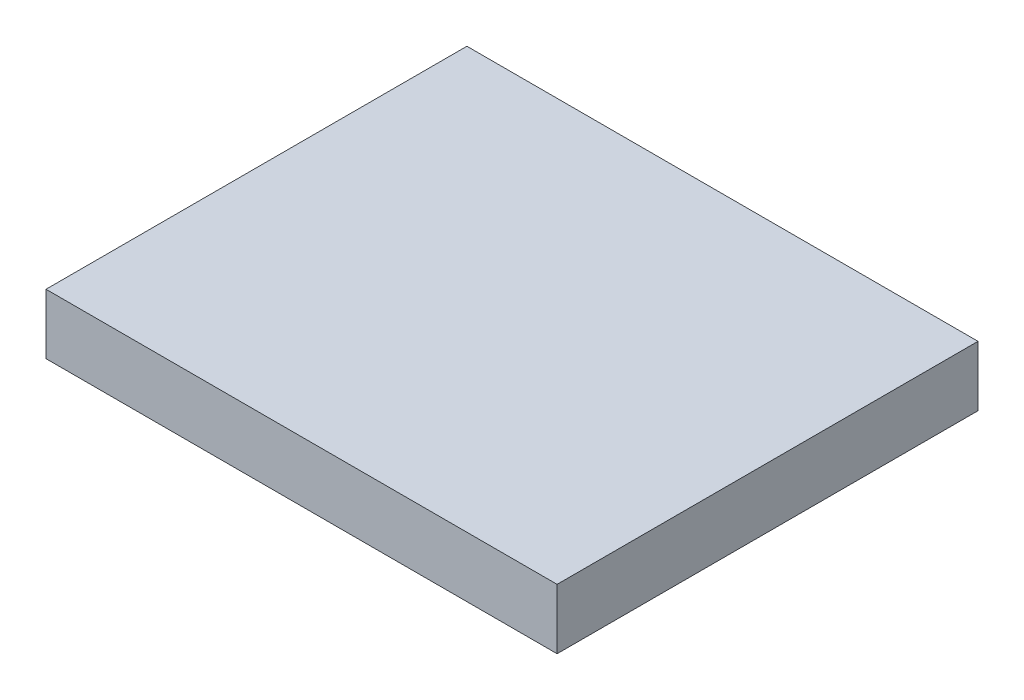
ISO-10303-21;
HEADER;
FILE_DESCRIPTION(('STEP AP214'),'2;1');
FILE_NAME('part.step','',(''),(''),'','','');
FILE_SCHEMA(('AUTOMOTIVE_DESIGN { 1 0 10303 214 1 1 1 1 }'));
ENDSEC;
DATA;
#1=APPLICATION_CONTEXT('core data for automotive mechanical design processes');
#2=APPLICATION_PROTOCOL_DEFINITION('international standard','automotive_design',2000,#1);
#3=PRODUCT_CONTEXT('',#1,'mechanical');
#4=PRODUCT('Part','Part','',(#3));
#5=PRODUCT_RELATED_PRODUCT_CATEGORY('part','',(#4));
#6=PRODUCT_DEFINITION_FORMATION('','',#4);
#7=PRODUCT_DEFINITION_CONTEXT('part definition',#1,'design');
#8=PRODUCT_DEFINITION('design','',#6,#7);
#9=PRODUCT_DEFINITION_SHAPE('','',#8);
#10=(LENGTH_UNIT() NAMED_UNIT(*) SI_UNIT(.MILLI.,.METRE.));
#11=(NAMED_UNIT(*) PLANE_ANGLE_UNIT() SI_UNIT($,.RADIAN.));
#12=(NAMED_UNIT(*) SI_UNIT($,.STERADIAN.) SOLID_ANGLE_UNIT());
#13=UNCERTAINTY_MEASURE_WITH_UNIT(LENGTH_MEASURE(1.E-05),#10,'distance_accuracy_value','');
#14=(GEOMETRIC_REPRESENTATION_CONTEXT(3) GLOBAL_UNCERTAINTY_ASSIGNED_CONTEXT((#13)) GLOBAL_UNIT_ASSIGNED_CONTEXT((#10,
#11,#12)) REPRESENTATION_CONTEXT('',''));
#15=CARTESIAN_POINT('',(0.,0.,0.));
#16=DIRECTION('',(0.,0.,1.));
#17=DIRECTION('',(1.,0.,0.));
#18=AXIS2_PLACEMENT_3D('',#15,#16,#17);
#19=CARTESIAN_POINT('',(-11.9675675675676,2.,-6.84864864864865));
#20=DIRECTION('',(1.,0.,0.));
#21=DIRECTION('',(0.,0.,-1.));
#22=AXIS2_PLACEMENT_3D('',#19,#20,#21);
#23=PLANE('',#22);
#24=DIRECTION('',(0.,0.,1.));
#25=VECTOR('',#24,1.);
#26=CARTESIAN_POINT('',(-11.9675675675676,0.,-6.84864864864865));
#27=LINE('',#26,#25);
#28=CARTESIAN_POINT('',(-11.9675675675676,0.,-6.84864864864865));
#29=VERTEX_POINT('',#28);
#30=CARTESIAN_POINT('',(-11.9675675675676,0.,7.15135135135136));
#31=VERTEX_POINT('',#30);
#32=EDGE_CURVE('E96',#29,#31,#27,.T.);
#33=ORIENTED_EDGE('',*,*,#32,.T.);
#34=DIRECTION('',(0.,-1.,0.));
#35=VECTOR('',#34,1.);
#36=CARTESIAN_POINT('',(-11.9675675675676,2.,7.15135135135136));
#37=LINE('',#36,#35);
#38=CARTESIAN_POINT('',(-11.9675675675676,2.,7.15135135135136));
#39=VERTEX_POINT('',#38);
#40=EDGE_CURVE('E11',#39,#31,#37,.T.);
#41=ORIENTED_EDGE('',*,*,#40,.F.);
#42=DIRECTION('',(0.,0.,1.));
#43=VECTOR('',#42,1.);
#44=CARTESIAN_POINT('',(-11.9675675675676,2.,-6.84864864864865));
#45=LINE('',#44,#43);
#46=CARTESIAN_POINT('',(-11.9675675675676,2.,-6.84864864864865));
#47=VERTEX_POINT('',#46);
#48=EDGE_CURVE('E84',#47,#39,#45,.T.);
#49=ORIENTED_EDGE('',*,*,#48,.F.);
#50=DIRECTION('',(0.,-1.,0.));
#51=VECTOR('',#50,1.);
#52=CARTESIAN_POINT('',(-11.9675675675676,2.,-6.84864864864865));
#53=LINE('',#52,#51);
#54=EDGE_CURVE('E92',#47,#29,#53,.T.);
#55=ORIENTED_EDGE('',*,*,#54,.T.);
#56=EDGE_LOOP('',(#33,#41,#49,#55));
#57=FACE_BOUND('',#56,.T.);
#58=ADVANCED_FACE('F33',(#57),#23,.F.);
#59=CARTESIAN_POINT('',(-11.9675675675676,2.,7.15135135135136));
#60=DIRECTION('',(0.,0.,-1.));
#61=DIRECTION('',(-1.,0.,0.));
#62=AXIS2_PLACEMENT_3D('',#59,#60,#61);
#63=PLANE('',#62);
#64=DIRECTION('',(1.,0.,0.));
#65=VECTOR('',#64,1.);
#66=CARTESIAN_POINT('',(-11.9675675675676,0.,7.15135135135136));
#67=LINE('',#66,#65);
#68=CARTESIAN_POINT('',(5.03243243243243,0.,7.15135135135135));
#69=VERTEX_POINT('',#68);
#70=EDGE_CURVE('E88',#31,#69,#67,.T.);
#71=ORIENTED_EDGE('',*,*,#70,.T.);
#72=DIRECTION('',(0.,-1.,0.));
#73=VECTOR('',#72,1.);
#74=CARTESIAN_POINT('',(5.03243243243243,2.,7.15135135135135));
#75=LINE('',#74,#73);
#76=CARTESIAN_POINT('',(5.03243243243243,2.,7.15135135135135));
#77=VERTEX_POINT('',#76);
#78=EDGE_CURVE('E41',#77,#69,#75,.T.);
#79=ORIENTED_EDGE('',*,*,#78,.F.);
#80=DIRECTION('',(1.,0.,0.));
#81=VECTOR('',#80,1.);
#82=CARTESIAN_POINT('',(-11.9675675675676,2.,7.15135135135136));
#83=LINE('',#82,#81);
#84=EDGE_CURVE('E79',#39,#77,#83,.T.);
#85=ORIENTED_EDGE('',*,*,#84,.F.);
#86=ORIENTED_EDGE('',*,*,#40,.T.);
#87=EDGE_LOOP('',(#71,#79,#85,#86));
#88=FACE_BOUND('',#87,.T.);
#89=ADVANCED_FACE('F87',(#88),#63,.F.);
#90=CARTESIAN_POINT('',(5.03243243243243,2.,-6.84864864864865));
#91=DIRECTION('',(-1.,0.,0.));
#92=DIRECTION('',(0.,0.,1.));
#93=AXIS2_PLACEMENT_3D('',#90,#91,#92);
#94=PLANE('',#93);
#95=DIRECTION('',(0.,0.,-1.));
#96=VECTOR('',#95,1.);
#97=CARTESIAN_POINT('',(5.03243243243243,0.,-6.84864864864865));
#98=LINE('',#97,#96);
#99=CARTESIAN_POINT('',(5.03243243243243,0.,-6.84864864864865));
#100=VERTEX_POINT('',#99);
#101=EDGE_CURVE('E66',#69,#100,#98,.T.);
#102=ORIENTED_EDGE('',*,*,#101,.T.);
#103=DIRECTION('',(0.,-1.,0.));
#104=VECTOR('',#103,1.);
#105=CARTESIAN_POINT('',(5.03243243243243,2.,-6.84864864864865));
#106=LINE('',#105,#104);
#107=CARTESIAN_POINT('',(5.03243243243243,2.,-6.84864864864865));
#108=VERTEX_POINT('',#107);
#109=EDGE_CURVE('E89',#108,#100,#106,.T.);
#110=ORIENTED_EDGE('',*,*,#109,.F.);
#111=DIRECTION('',(0.,0.,-1.));
#112=VECTOR('',#111,1.);
#113=CARTESIAN_POINT('',(5.03243243243243,2.,-6.84864864864865));
#114=LINE('',#113,#112);
#115=EDGE_CURVE('E82',#77,#108,#114,.T.);
#116=ORIENTED_EDGE('',*,*,#115,.F.);
#117=ORIENTED_EDGE('',*,*,#78,.T.);
#118=EDGE_LOOP('',(#102,#110,#116,#117));
#119=FACE_BOUND('',#118,.T.);
#120=ADVANCED_FACE('F90',(#119),#94,.F.);
#121=CARTESIAN_POINT('',(-11.9675675675676,2.,-6.84864864864865));
#122=DIRECTION('',(0.,0.,1.));
#123=DIRECTION('',(1.,0.,0.));
#124=AXIS2_PLACEMENT_3D('',#121,#122,#123);
#125=PLANE('',#124);
#126=DIRECTION('',(-1.,0.,0.));
#127=VECTOR('',#126,1.);
#128=CARTESIAN_POINT('',(-11.9675675675676,0.,-6.84864864864865));
#129=LINE('',#128,#127);
#130=EDGE_CURVE('E72',#100,#29,#129,.T.);
#131=ORIENTED_EDGE('',*,*,#130,.T.);
#132=ORIENTED_EDGE('',*,*,#54,.F.);
#133=DIRECTION('',(-1.,0.,0.));
#134=VECTOR('',#133,1.);
#135=CARTESIAN_POINT('',(-11.9675675675676,2.,-6.84864864864865));
#136=LINE('',#135,#134);
#137=EDGE_CURVE('E49',#108,#47,#136,.T.);
#138=ORIENTED_EDGE('',*,*,#137,.F.);
#139=ORIENTED_EDGE('',*,*,#109,.T.);
#140=EDGE_LOOP('',(#131,#132,#138,#139));
#141=FACE_BOUND('',#140,.T.);
#142=ADVANCED_FACE('F103',(#141),#125,.F.);
#143=CARTESIAN_POINT('',(0.,2.,0.));
#144=DIRECTION('',(0.,1.,0.));
#145=DIRECTION('',(0.,0.,1.));
#146=AXIS2_PLACEMENT_3D('',#143,#144,#145);
#147=PLANE('',#146);
#148=ORIENTED_EDGE('',*,*,#48,.T.);
#149=ORIENTED_EDGE('',*,*,#84,.T.);
#150=ORIENTED_EDGE('',*,*,#115,.T.);
#151=ORIENTED_EDGE('',*,*,#137,.T.);
#152=EDGE_LOOP('',(#148,#149,#150,#151));
#153=FACE_BOUND('',#152,.T.);
#154=ADVANCED_FACE('F80',(#153),#147,.T.);
#155=CARTESIAN_POINT('',(0.,0.,0.));
#156=DIRECTION('',(0.,1.,0.));
#157=DIRECTION('',(0.,0.,1.));
#158=AXIS2_PLACEMENT_3D('',#155,#156,#157);
#159=PLANE('',#158);
#160=ORIENTED_EDGE('',*,*,#32,.F.);
#161=ORIENTED_EDGE('',*,*,#130,.F.);
#162=ORIENTED_EDGE('',*,*,#101,.F.);
#163=ORIENTED_EDGE('',*,*,#70,.F.);
#164=EDGE_LOOP('',(#160,#161,#162,#163));
#165=FACE_BOUND('',#164,.T.);
#166=ADVANCED_FACE('F106',(#165),#159,.F.);
#167=CLOSED_SHELL('',(#58,#89,#120,#142,#154,#166));
#168=MANIFOLD_SOLID_BREP('B2',#167);
#169=ADVANCED_BREP_SHAPE_REPRESENTATION('',(#18,#168),#14);
#170=SHAPE_DEFINITION_REPRESENTATION(#9,#169);
ENDSEC;
END-ISO-10303-21;
